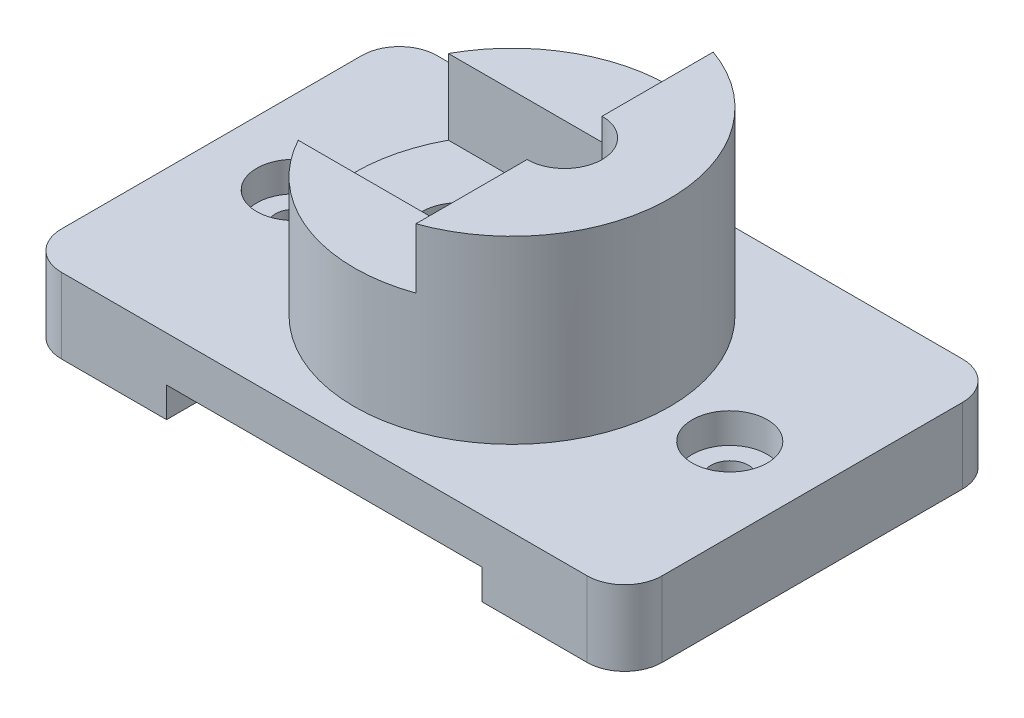
ISO-10303-21;
HEADER;
FILE_DESCRIPTION(('STEP AP214'),'2;1');
FILE_NAME('part.step','',(''),(''),'','','');
FILE_SCHEMA(('AUTOMOTIVE_DESIGN { 1 0 10303 214 1 1 1 1 }'));
ENDSEC;
DATA;
#1=APPLICATION_CONTEXT('core data for automotive mechanical design processes');
#2=APPLICATION_PROTOCOL_DEFINITION('international standard','automotive_design',2000,#1);
#3=PRODUCT_CONTEXT('',#1,'mechanical');
#4=PRODUCT('Part','Part','',(#3));
#5=PRODUCT_RELATED_PRODUCT_CATEGORY('part','',(#4));
#6=PRODUCT_DEFINITION_FORMATION('','',#4);
#7=PRODUCT_DEFINITION_CONTEXT('part definition',#1,'design');
#8=PRODUCT_DEFINITION('design','',#6,#7);
#9=PRODUCT_DEFINITION_SHAPE('','',#8);
#10=(LENGTH_UNIT() NAMED_UNIT(*) SI_UNIT(.MILLI.,.METRE.));
#11=(NAMED_UNIT(*) PLANE_ANGLE_UNIT() SI_UNIT($,.RADIAN.));
#12=(NAMED_UNIT(*) SI_UNIT($,.STERADIAN.) SOLID_ANGLE_UNIT());
#13=UNCERTAINTY_MEASURE_WITH_UNIT(LENGTH_MEASURE(1.E-05),#10,'distance_accuracy_value','');
#14=(GEOMETRIC_REPRESENTATION_CONTEXT(3) GLOBAL_UNCERTAINTY_ASSIGNED_CONTEXT((#13)) GLOBAL_UNIT_ASSIGNED_CONTEXT((#10,
#11,#12)) REPRESENTATION_CONTEXT('',''));
#15=CARTESIAN_POINT('',(0.,0.,0.));
#16=DIRECTION('',(0.,0.,1.));
#17=DIRECTION('',(1.,0.,0.));
#18=AXIS2_PLACEMENT_3D('',#15,#16,#17);
#19=CARTESIAN_POINT('',(-35.,0.,20.));
#20=DIRECTION('',(0.,-1.,0.));
#21=DIRECTION('',(0.,0.,-1.));
#22=AXIS2_PLACEMENT_3D('',#19,#20,#21);
#23=PLANE('',#22);
#24=DIRECTION('',(0.,0.,1.));
#25=VECTOR('',#24,1.);
#26=CARTESIAN_POINT('',(21.,0.,-25.));
#27=LINE('',#26,#25);
#28=CARTESIAN_POINT('',(21.,0.,-25.));
#29=VERTEX_POINT('',#28);
#30=CARTESIAN_POINT('',(21.,0.,25.));
#31=VERTEX_POINT('',#30);
#32=EDGE_CURVE('E205',#29,#31,#27,.T.);
#33=ORIENTED_EDGE('',*,*,#32,.F.);
#34=DIRECTION('',(-1.,0.,0.));
#35=VECTOR('',#34,1.);
#36=CARTESIAN_POINT('',(-35.,0.,-25.));
#37=LINE('',#36,#35);
#38=CARTESIAN_POINT('',(35.,0.,-25.));
#39=VERTEX_POINT('',#38);
#40=EDGE_CURVE('E359',#39,#29,#37,.T.);
#41=ORIENTED_EDGE('',*,*,#40,.F.);
#42=CARTESIAN_POINT('',(35.,0.,-20.));
#43=DIRECTION('',(0.,1.,0.));
#44=DIRECTION('',(0.,0.,-1.));
#45=AXIS2_PLACEMENT_3D('',#42,#43,#44);
#46=CIRCLE('',#45,5.);
#47=CARTESIAN_POINT('',(40.,0.,-20.));
#48=VERTEX_POINT('',#47);
#49=EDGE_CURVE('E356',#48,#39,#46,.T.);
#50=ORIENTED_EDGE('',*,*,#49,.F.);
#51=DIRECTION('',(0.,0.,-1.));
#52=VECTOR('',#51,1.);
#53=CARTESIAN_POINT('',(40.,0.,-20.));
#54=LINE('',#53,#52);
#55=CARTESIAN_POINT('',(40.,0.,20.));
#56=VERTEX_POINT('',#55);
#57=EDGE_CURVE('E354',#56,#48,#54,.T.);
#58=ORIENTED_EDGE('',*,*,#57,.F.);
#59=CARTESIAN_POINT('',(35.,0.,20.));
#60=DIRECTION('',(0.,1.,0.));
#61=DIRECTION('',(0.,0.,-1.));
#62=AXIS2_PLACEMENT_3D('',#59,#60,#61);
#63=CIRCLE('',#62,5.);
#64=CARTESIAN_POINT('',(35.,0.,25.));
#65=VERTEX_POINT('',#64);
#66=EDGE_CURVE('E352',#65,#56,#63,.T.);
#67=ORIENTED_EDGE('',*,*,#66,.F.);
#68=DIRECTION('',(1.,0.,0.));
#69=VECTOR('',#68,1.);
#70=CARTESIAN_POINT('',(-35.,0.,25.));
#71=LINE('',#70,#69);
#72=EDGE_CURVE('E349',#31,#65,#71,.T.);
#73=ORIENTED_EDGE('',*,*,#72,.F.);
#74=EDGE_LOOP('',(#33,#41,#50,#58,#67,#73));
#75=FACE_BOUND('',#74,.T.);
#76=CARTESIAN_POINT('',(29.,0.,0.));
#77=DIRECTION('',(0.,-1.,0.));
#78=DIRECTION('',(0.,0.,1.));
#79=AXIS2_PLACEMENT_3D('',#76,#77,#78);
#80=CIRCLE('',#79,2.5);
#81=CARTESIAN_POINT('',(29.,0.,2.5));
#82=VERTEX_POINT('',#81);
#83=EDGE_CURVE('E231',#82,#82,#80,.T.);
#84=ORIENTED_EDGE('',*,*,#83,.F.);
#85=EDGE_LOOP('',(#84));
#86=FACE_BOUND('',#85,.T.);
#87=ADVANCED_FACE('F35',(#75,#86),#23,.T.);
#88=CARTESIAN_POINT('',(-7.,0.,0.));
#89=DIRECTION('',(0.,1.,0.));
#90=DIRECTION('',(0.,0.,1.));
#91=AXIS2_PLACEMENT_3D('',#88,#89,#90);
#92=CYLINDRICAL_SURFACE('',#91,5.);
#93=DIRECTION('',(0.,1.,0.));
#94=VECTOR('',#93,1.);
#95=CARTESIAN_POINT('',(-7.,0.,5.));
#96=LINE('',#95,#94);
#97=CARTESIAN_POINT('',(-7.,4.,5.));
#98=VERTEX_POINT('',#97);
#99=CARTESIAN_POINT('',(-7.,16.,5.));
#100=VERTEX_POINT('',#99);
#101=EDGE_CURVE('E312',#98,#100,#96,.T.);
#102=ORIENTED_EDGE('',*,*,#101,.F.);
#103=CARTESIAN_POINT('',(-7.,4.,0.));
#104=DIRECTION('',(0.,1.,0.));
#105=DIRECTION('',(-1.,0.,0.));
#106=AXIS2_PLACEMENT_3D('',#103,#104,#105);
#107=CIRCLE('',#106,5.);
#108=CARTESIAN_POINT('',(-7.,4.,-5.));
#109=VERTEX_POINT('',#108);
#110=EDGE_CURVE('E227',#98,#109,#107,.F.);
#111=ORIENTED_EDGE('',*,*,#110,.T.);
#112=DIRECTION('',(0.,1.,0.));
#113=VECTOR('',#112,1.);
#114=CARTESIAN_POINT('',(-7.,0.,-5.));
#115=LINE('',#114,#113);
#116=CARTESIAN_POINT('',(-7.,16.,-5.));
#117=VERTEX_POINT('',#116);
#118=EDGE_CURVE('E313',#109,#117,#115,.T.);
#119=ORIENTED_EDGE('',*,*,#118,.T.);
#120=CARTESIAN_POINT('',(-7.,16.,0.));
#121=DIRECTION('',(0.,1.,0.));
#122=DIRECTION('',(0.,0.,1.));
#123=AXIS2_PLACEMENT_3D('',#120,#121,#122);
#124=CIRCLE('',#123,5.);
#125=EDGE_CURVE('E284',#100,#117,#124,.F.);
#126=ORIENTED_EDGE('',*,*,#125,.F.);
#127=EDGE_LOOP('',(#102,#111,#119,#126));
#128=FACE_BOUND('',#127,.T.);
#129=ADVANCED_FACE('F439',(#128),#92,.F.);
#130=CARTESIAN_POINT('',(-7.,0.,-5.));
#131=DIRECTION('',(0.,0.,-1.));
#132=DIRECTION('',(-1.,0.,0.));
#133=AXIS2_PLACEMENT_3D('',#130,#131,#132);
#134=PLANE('',#133);
#135=ORIENTED_EDGE('',*,*,#118,.F.);
#136=DIRECTION('',(1.,0.,0.));
#137=VECTOR('',#136,1.);
#138=CARTESIAN_POINT('',(-7.,4.,-5.));
#139=LINE('',#138,#137);
#140=CARTESIAN_POINT('',(7.,4.,-5.));
#141=VERTEX_POINT('',#140);
#142=EDGE_CURVE('E224',#109,#141,#139,.T.);
#143=ORIENTED_EDGE('',*,*,#142,.T.);
#144=DIRECTION('',(0.,1.,0.));
#145=VECTOR('',#144,1.);
#146=CARTESIAN_POINT('',(7.,0.,-5.));
#147=LINE('',#146,#145);
#148=CARTESIAN_POINT('',(7.00000000000001,16.,-5.));
#149=VERTEX_POINT('',#148);
#150=EDGE_CURVE('E316',#141,#149,#147,.T.);
#151=ORIENTED_EDGE('',*,*,#150,.T.);
#152=DIRECTION('',(1.,0.,0.));
#153=VECTOR('',#152,1.);
#154=CARTESIAN_POINT('',(-7.,16.,-5.));
#155=LINE('',#154,#153);
#156=EDGE_CURVE('E287',#117,#149,#155,.T.);
#157=ORIENTED_EDGE('',*,*,#156,.F.);
#158=EDGE_LOOP('',(#135,#143,#151,#157));
#159=FACE_BOUND('',#158,.T.);
#160=ADVANCED_FACE('F444',(#159),#134,.F.);
#161=CARTESIAN_POINT('',(7.,0.,5.));
#162=DIRECTION('',(0.,0.,1.));
#163=DIRECTION('',(1.,0.,0.));
#164=AXIS2_PLACEMENT_3D('',#161,#162,#163);
#165=PLANE('',#164);
#166=DIRECTION('',(0.,1.,0.));
#167=VECTOR('',#166,1.);
#168=CARTESIAN_POINT('',(7.,0.,5.));
#169=LINE('',#168,#167);
#170=CARTESIAN_POINT('',(7.,4.,5.));
#171=VERTEX_POINT('',#170);
#172=CARTESIAN_POINT('',(7.00000000000001,16.,5.));
#173=VERTEX_POINT('',#172);
#174=EDGE_CURVE('E318',#171,#173,#169,.T.);
#175=ORIENTED_EDGE('',*,*,#174,.F.);
#176=DIRECTION('',(-1.,0.,0.));
#177=VECTOR('',#176,1.);
#178=CARTESIAN_POINT('',(7.,4.,5.));
#179=LINE('',#178,#177);
#180=EDGE_CURVE('E58',#171,#98,#179,.T.);
#181=ORIENTED_EDGE('',*,*,#180,.T.);
#182=ORIENTED_EDGE('',*,*,#101,.T.);
#183=DIRECTION('',(-1.,0.,0.));
#184=VECTOR('',#183,1.);
#185=CARTESIAN_POINT('',(7.,16.,5.));
#186=LINE('',#185,#184);
#187=EDGE_CURVE('E276',#173,#100,#186,.T.);
#188=ORIENTED_EDGE('',*,*,#187,.F.);
#189=EDGE_LOOP('',(#175,#181,#182,#188));
#190=FACE_BOUND('',#189,.T.);
#191=ADVANCED_FACE('F468',(#190),#165,.F.);
#192=CARTESIAN_POINT('',(0.,26.,0.));
#193=DIRECTION('',(0.,1.,0.));
#194=DIRECTION('',(0.,0.,1.));
#195=AXIS2_PLACEMENT_3D('',#192,#193,#194);
#196=PLANE('',#195);
#197=DIRECTION('',(-1.,0.,0.));
#198=VECTOR('',#197,1.);
#199=CARTESIAN_POINT('',(-18.4661853126194,26.,-10.));
#200=LINE('',#199,#198);
#201=CARTESIAN_POINT('',(7.00000000000001,26.,-10.));
#202=VERTEX_POINT('',#201);
#203=CARTESIAN_POINT('',(-18.4661853126194,26.,-10.));
#204=VERTEX_POINT('',#203);
#205=EDGE_CURVE('E259',#202,#204,#200,.T.);
#206=ORIENTED_EDGE('',*,*,#205,.F.);
#207=DIRECTION('',(0.,0.,-1.));
#208=VECTOR('',#207,1.);
#209=CARTESIAN_POINT('',(7.,26.,-19.7989898732233));
#210=LINE('',#209,#208);
#211=CARTESIAN_POINT('',(7.,26.,-19.7989898732233));
#212=VERTEX_POINT('',#211);
#213=EDGE_CURVE('E294',#202,#212,#210,.T.);
#214=ORIENTED_EDGE('',*,*,#213,.T.);
#215=CARTESIAN_POINT('',(0.,26.,0.));
#216=DIRECTION('',(0.,1.,0.));
#217=DIRECTION('',(0.,0.,1.));
#218=AXIS2_PLACEMENT_3D('',#215,#216,#217);
#219=CIRCLE('',#218,21.);
#220=EDGE_CURVE('E291',#212,#204,#219,.T.);
#221=ORIENTED_EDGE('',*,*,#220,.T.);
#222=EDGE_LOOP('',(#206,#214,#221));
#223=FACE_BOUND('',#222,.T.);
#224=ADVANCED_FACE('F471',(#223),#196,.T.);
#225=CARTESIAN_POINT('',(-35.,10.,20.));
#226=DIRECTION('',(0.,-1.,0.));
#227=DIRECTION('',(0.,0.,-1.));
#228=AXIS2_PLACEMENT_3D('',#225,#226,#227);
#229=CYLINDRICAL_SURFACE('',#228,5.);
#230=CARTESIAN_POINT('',(-35.,0.,20.));
#231=DIRECTION('',(0.,1.,0.));
#232=DIRECTION('',(0.,0.,-1.));
#233=AXIS2_PLACEMENT_3D('',#230,#231,#232);
#234=CIRCLE('',#233,5.);
#235=CARTESIAN_POINT('',(-40.,0.,20.));
#236=VERTEX_POINT('',#235);
#237=CARTESIAN_POINT('',(-35.,0.,25.));
#238=VERTEX_POINT('',#237);
#239=EDGE_CURVE('E324',#236,#238,#234,.T.);
#240=ORIENTED_EDGE('',*,*,#239,.T.);
#241=DIRECTION('',(0.,-1.,0.));
#242=VECTOR('',#241,1.);
#243=CARTESIAN_POINT('',(-35.,10.,25.));
#244=LINE('',#243,#242);
#245=CARTESIAN_POINT('',(-35.,10.,25.));
#246=VERTEX_POINT('',#245);
#247=EDGE_CURVE('E327',#246,#238,#244,.T.);
#248=ORIENTED_EDGE('',*,*,#247,.F.);
#249=CARTESIAN_POINT('',(-35.,10.,20.));
#250=DIRECTION('',(0.,1.,0.));
#251=DIRECTION('',(0.,0.,-1.));
#252=AXIS2_PLACEMENT_3D('',#249,#250,#251);
#253=CIRCLE('',#252,5.);
#254=CARTESIAN_POINT('',(-40.,10.,20.));
#255=VERTEX_POINT('',#254);
#256=EDGE_CURVE('E328',#255,#246,#253,.T.);
#257=ORIENTED_EDGE('',*,*,#256,.F.);
#258=DIRECTION('',(0.,-1.,0.));
#259=VECTOR('',#258,1.);
#260=CARTESIAN_POINT('',(-40.,10.,20.));
#261=LINE('',#260,#259);
#262=EDGE_CURVE('E346',#255,#236,#261,.T.);
#263=ORIENTED_EDGE('',*,*,#262,.T.);
#264=EDGE_LOOP('',(#240,#248,#257,#263));
#265=FACE_BOUND('',#264,.T.);
#266=ADVANCED_FACE('F37',(#265),#229,.T.);
#267=CARTESIAN_POINT('',(-35.,10.,25.));
#268=DIRECTION('',(0.,0.,-1.));
#269=DIRECTION('',(-1.,0.,0.));
#270=AXIS2_PLACEMENT_3D('',#267,#268,#269);
#271=PLANE('',#270);
#272=DIRECTION('',(-1.,0.,0.));
#273=VECTOR('',#272,1.);
#274=CARTESIAN_POINT('',(21.,4.,25.));
#275=LINE('',#274,#273);
#276=CARTESIAN_POINT('',(21.,4.,25.));
#277=VERTEX_POINT('',#276);
#278=CARTESIAN_POINT('',(-21.,3.99999999999999,25.));
#279=VERTEX_POINT('',#278);
#280=EDGE_CURVE('E193',#277,#279,#275,.T.);
#281=ORIENTED_EDGE('',*,*,#280,.F.);
#282=DIRECTION('',(0.,1.,0.));
#283=VECTOR('',#282,1.);
#284=CARTESIAN_POINT('',(21.,0.,25.));
#285=LINE('',#284,#283);
#286=EDGE_CURVE('E202',#31,#277,#285,.T.);
#287=ORIENTED_EDGE('',*,*,#286,.F.);
#288=ORIENTED_EDGE('',*,*,#72,.T.);
#289=DIRECTION('',(0.,-1.,0.));
#290=VECTOR('',#289,1.);
#291=CARTESIAN_POINT('',(35.,10.,25.));
#292=LINE('',#291,#290);
#293=CARTESIAN_POINT('',(35.,10.,25.));
#294=VERTEX_POINT('',#293);
#295=EDGE_CURVE('E382',#294,#65,#292,.T.);
#296=ORIENTED_EDGE('',*,*,#295,.F.);
#297=DIRECTION('',(1.,0.,0.));
#298=VECTOR('',#297,1.);
#299=CARTESIAN_POINT('',(-35.,10.,25.));
#300=LINE('',#299,#298);
#301=EDGE_CURVE('E331',#246,#294,#300,.T.);
#302=ORIENTED_EDGE('',*,*,#301,.F.);
#303=ORIENTED_EDGE('',*,*,#247,.T.);
#304=CARTESIAN_POINT('',(-21.,0.,25.));
#305=VERTEX_POINT('',#304);
#306=EDGE_CURVE('E350',#238,#305,#71,.T.);
#307=ORIENTED_EDGE('',*,*,#306,.T.);
#308=DIRECTION('',(0.,-1.,0.));
#309=VECTOR('',#308,1.);
#310=CARTESIAN_POINT('',(-21.,0.,25.));
#311=LINE('',#310,#309);
#312=EDGE_CURVE('E50',#279,#305,#311,.T.);
#313=ORIENTED_EDGE('',*,*,#312,.F.);
#314=EDGE_LOOP('',(#281,#287,#288,#296,#302,#303,#307,#313));
#315=FACE_BOUND('',#314,.T.);
#316=ADVANCED_FACE('F209',(#315),#271,.F.);
#317=CARTESIAN_POINT('',(35.,10.,20.));
#318=DIRECTION('',(0.,-1.,0.));
#319=DIRECTION('',(0.,0.,-1.));
#320=AXIS2_PLACEMENT_3D('',#317,#318,#319);
#321=CYLINDRICAL_SURFACE('',#320,5.);
#322=ORIENTED_EDGE('',*,*,#66,.T.);
#323=DIRECTION('',(0.,-1.,0.));
#324=VECTOR('',#323,1.);
#325=CARTESIAN_POINT('',(40.,10.,20.));
#326=LINE('',#325,#324);
#327=CARTESIAN_POINT('',(40.,10.,20.));
#328=VERTEX_POINT('',#327);
#329=EDGE_CURVE('E379',#328,#56,#326,.T.);
#330=ORIENTED_EDGE('',*,*,#329,.F.);
#331=CARTESIAN_POINT('',(35.,10.,20.));
#332=DIRECTION('',(0.,1.,0.));
#333=DIRECTION('',(0.,0.,-1.));
#334=AXIS2_PLACEMENT_3D('',#331,#332,#333);
#335=CIRCLE('',#334,5.);
#336=EDGE_CURVE('E334',#294,#328,#335,.T.);
#337=ORIENTED_EDGE('',*,*,#336,.F.);
#338=ORIENTED_EDGE('',*,*,#295,.T.);
#339=EDGE_LOOP('',(#322,#330,#337,#338));
#340=FACE_BOUND('',#339,.T.);
#341=ADVANCED_FACE('F410',(#340),#321,.T.);
#342=CARTESIAN_POINT('',(40.,10.,-20.));
#343=DIRECTION('',(-1.,0.,0.));
#344=DIRECTION('',(0.,0.,1.));
#345=AXIS2_PLACEMENT_3D('',#342,#343,#344);
#346=PLANE('',#345);
#347=ORIENTED_EDGE('',*,*,#57,.T.);
#348=DIRECTION('',(0.,-1.,0.));
#349=VECTOR('',#348,1.);
#350=CARTESIAN_POINT('',(40.,10.,-20.));
#351=LINE('',#350,#349);
#352=CARTESIAN_POINT('',(40.,10.,-20.));
#353=VERTEX_POINT('',#352);
#354=EDGE_CURVE('E376',#353,#48,#351,.T.);
#355=ORIENTED_EDGE('',*,*,#354,.F.);
#356=DIRECTION('',(0.,0.,-1.));
#357=VECTOR('',#356,1.);
#358=CARTESIAN_POINT('',(40.,10.,-20.));
#359=LINE('',#358,#357);
#360=EDGE_CURVE('E336',#328,#353,#359,.T.);
#361=ORIENTED_EDGE('',*,*,#360,.F.);
#362=ORIENTED_EDGE('',*,*,#329,.T.);
#363=EDGE_LOOP('',(#347,#355,#361,#362));
#364=FACE_BOUND('',#363,.T.);
#365=ADVANCED_FACE('F429',(#364),#346,.F.);
#366=CARTESIAN_POINT('',(35.,10.,-20.));
#367=DIRECTION('',(0.,-1.,0.));
#368=DIRECTION('',(0.,0.,-1.));
#369=AXIS2_PLACEMENT_3D('',#366,#367,#368);
#370=CYLINDRICAL_SURFACE('',#369,5.);
#371=ORIENTED_EDGE('',*,*,#49,.T.);
#372=DIRECTION('',(0.,-1.,0.));
#373=VECTOR('',#372,1.);
#374=CARTESIAN_POINT('',(35.,10.,-25.));
#375=LINE('',#374,#373);
#376=CARTESIAN_POINT('',(35.,10.,-25.));
#377=VERTEX_POINT('',#376);
#378=EDGE_CURVE('E373',#377,#39,#375,.T.);
#379=ORIENTED_EDGE('',*,*,#378,.F.);
#380=CARTESIAN_POINT('',(35.,10.,-20.));
#381=DIRECTION('',(0.,1.,0.));
#382=DIRECTION('',(0.,0.,-1.));
#383=AXIS2_PLACEMENT_3D('',#380,#381,#382);
#384=CIRCLE('',#383,5.);
#385=EDGE_CURVE('E338',#353,#377,#384,.T.);
#386=ORIENTED_EDGE('',*,*,#385,.F.);
#387=ORIENTED_EDGE('',*,*,#354,.T.);
#388=EDGE_LOOP('',(#371,#379,#386,#387));
#389=FACE_BOUND('',#388,.T.);
#390=ADVANCED_FACE('F427',(#389),#370,.T.);
#391=CARTESIAN_POINT('',(-35.,10.,-25.));
#392=DIRECTION('',(0.,0.,1.));
#393=DIRECTION('',(1.,0.,0.));
#394=AXIS2_PLACEMENT_3D('',#391,#392,#393);
#395=PLANE('',#394);
#396=ORIENTED_EDGE('',*,*,#40,.T.);
#397=DIRECTION('',(0.,1.,0.));
#398=VECTOR('',#397,1.);
#399=CARTESIAN_POINT('',(21.,0.,-25.));
#400=LINE('',#399,#398);
#401=CARTESIAN_POINT('',(21.,4.,-25.));
#402=VERTEX_POINT('',#401);
#403=EDGE_CURVE('E212',#29,#402,#400,.T.);
#404=ORIENTED_EDGE('',*,*,#403,.T.);
#405=DIRECTION('',(-1.,0.,0.));
#406=VECTOR('',#405,1.);
#407=CARTESIAN_POINT('',(21.,4.,-25.));
#408=LINE('',#407,#406);
#409=CARTESIAN_POINT('',(-21.,3.99999999999999,-25.));
#410=VERTEX_POINT('',#409);
#411=EDGE_CURVE('E195',#402,#410,#408,.T.);
#412=ORIENTED_EDGE('',*,*,#411,.T.);
#413=DIRECTION('',(0.,-1.,0.));
#414=VECTOR('',#413,1.);
#415=CARTESIAN_POINT('',(-21.,0.,-25.));
#416=LINE('',#415,#414);
#417=CARTESIAN_POINT('',(-21.,0.,-25.));
#418=VERTEX_POINT('',#417);
#419=EDGE_CURVE('E199',#410,#418,#416,.T.);
#420=ORIENTED_EDGE('',*,*,#419,.T.);
#421=CARTESIAN_POINT('',(-35.,0.,-25.));
#422=VERTEX_POINT('',#421);
#423=EDGE_CURVE('E358',#418,#422,#37,.T.);
#424=ORIENTED_EDGE('',*,*,#423,.T.);
#425=DIRECTION('',(0.,-1.,0.));
#426=VECTOR('',#425,1.);
#427=CARTESIAN_POINT('',(-35.,10.,-25.));
#428=LINE('',#427,#426);
#429=CARTESIAN_POINT('',(-35.,10.,-25.));
#430=VERTEX_POINT('',#429);
#431=EDGE_CURVE('E370',#430,#422,#428,.T.);
#432=ORIENTED_EDGE('',*,*,#431,.F.);
#433=DIRECTION('',(-1.,0.,0.));
#434=VECTOR('',#433,1.);
#435=CARTESIAN_POINT('',(-35.,10.,-25.));
#436=LINE('',#435,#434);
#437=EDGE_CURVE('E340',#377,#430,#436,.T.);
#438=ORIENTED_EDGE('',*,*,#437,.F.);
#439=ORIENTED_EDGE('',*,*,#378,.T.);
#440=EDGE_LOOP('',(#396,#404,#412,#420,#424,#432,#438,#439));
#441=FACE_BOUND('',#440,.T.);
#442=ADVANCED_FACE('F400',(#441),#395,.F.);
#443=CARTESIAN_POINT('',(-35.,10.,-20.));
#444=DIRECTION('',(0.,-1.,0.));
#445=DIRECTION('',(0.,0.,-1.));
#446=AXIS2_PLACEMENT_3D('',#443,#444,#445);
#447=CYLINDRICAL_SURFACE('',#446,5.);
#448=CARTESIAN_POINT('',(-35.,0.,-20.));
#449=DIRECTION('',(0.,1.,0.));
#450=DIRECTION('',(0.,0.,1.));
#451=AXIS2_PLACEMENT_3D('',#448,#449,#450);
#452=CIRCLE('',#451,5.);
#453=CARTESIAN_POINT('',(-40.,0.,-20.));
#454=VERTEX_POINT('',#453);
#455=EDGE_CURVE('E362',#422,#454,#452,.T.);
#456=ORIENTED_EDGE('',*,*,#455,.T.);
#457=DIRECTION('',(0.,-1.,0.));
#458=VECTOR('',#457,1.);
#459=CARTESIAN_POINT('',(-40.,10.,-20.));
#460=LINE('',#459,#458);
#461=CARTESIAN_POINT('',(-40.,10.,-20.));
#462=VERTEX_POINT('',#461);
#463=EDGE_CURVE('E367',#462,#454,#460,.T.);
#464=ORIENTED_EDGE('',*,*,#463,.F.);
#465=CARTESIAN_POINT('',(-35.,10.,-20.));
#466=DIRECTION('',(0.,1.,0.));
#467=DIRECTION('',(0.,0.,1.));
#468=AXIS2_PLACEMENT_3D('',#465,#466,#467);
#469=CIRCLE('',#468,5.);
#470=EDGE_CURVE('E342',#430,#462,#469,.T.);
#471=ORIENTED_EDGE('',*,*,#470,.F.);
#472=ORIENTED_EDGE('',*,*,#431,.T.);
#473=EDGE_LOOP('',(#456,#464,#471,#472));
#474=FACE_BOUND('',#473,.T.);
#475=ADVANCED_FACE('F422',(#474),#447,.T.);
#476=CARTESIAN_POINT('',(-40.,10.,-20.));
#477=DIRECTION('',(1.,0.,0.));
#478=DIRECTION('',(0.,0.,-1.));
#479=AXIS2_PLACEMENT_3D('',#476,#477,#478);
#480=PLANE('',#479);
#481=DIRECTION('',(0.,0.,1.));
#482=VECTOR('',#481,1.);
#483=CARTESIAN_POINT('',(-40.,0.,-20.));
#484=LINE('',#483,#482);
#485=EDGE_CURVE('E332',#454,#236,#484,.T.);
#486=ORIENTED_EDGE('',*,*,#485,.T.);
#487=ORIENTED_EDGE('',*,*,#262,.F.);
#488=DIRECTION('',(0.,0.,1.));
#489=VECTOR('',#488,1.);
#490=CARTESIAN_POINT('',(-40.,10.,-20.));
#491=LINE('',#490,#489);
#492=EDGE_CURVE('E344',#462,#255,#491,.T.);
#493=ORIENTED_EDGE('',*,*,#492,.F.);
#494=ORIENTED_EDGE('',*,*,#463,.T.);
#495=EDGE_LOOP('',(#486,#487,#493,#494));
#496=FACE_BOUND('',#495,.T.);
#497=ADVANCED_FACE('F420',(#496),#480,.F.);
#498=CARTESIAN_POINT('',(-35.,10.,20.));
#499=DIRECTION('',(0.,-1.,0.));
#500=DIRECTION('',(0.,0.,-1.));
#501=AXIS2_PLACEMENT_3D('',#498,#499,#500);
#502=PLANE('',#501);
#503=CARTESIAN_POINT('',(29.,10.,0.));
#504=DIRECTION('',(0.,-1.,0.));
#505=DIRECTION('',(0.,0.,1.));
#506=AXIS2_PLACEMENT_3D('',#503,#504,#505);
#507=CIRCLE('',#506,5.);
#508=CARTESIAN_POINT('',(29.,10.,5.));
#509=VERTEX_POINT('',#508);
#510=EDGE_CURVE('E234',#509,#509,#507,.T.);
#511=ORIENTED_EDGE('',*,*,#510,.T.);
#512=EDGE_LOOP('',(#511));
#513=FACE_BOUND('',#512,.T.);
#514=CARTESIAN_POINT('',(-29.,10.,0.));
#515=DIRECTION('',(0.,1.,0.));
#516=DIRECTION('',(0.,0.,1.));
#517=AXIS2_PLACEMENT_3D('',#514,#515,#516);
#518=CIRCLE('',#517,5.);
#519=CARTESIAN_POINT('',(-29.,10.,5.));
#520=VERTEX_POINT('',#519);
#521=EDGE_CURVE('E246',#520,#520,#518,.T.);
#522=ORIENTED_EDGE('',*,*,#521,.F.);
#523=EDGE_LOOP('',(#522));
#524=FACE_BOUND('',#523,.T.);
#525=CARTESIAN_POINT('',(0.,10.,0.));
#526=DIRECTION('',(0.,-1.,0.));
#527=DIRECTION('',(0.,0.,-1.));
#528=AXIS2_PLACEMENT_3D('',#525,#526,#527);
#529=CIRCLE('',#528,21.);
#530=CARTESIAN_POINT('',(0.,10.,-21.));
#531=VERTEX_POINT('',#530);
#532=EDGE_CURVE('E43',#531,#531,#529,.F.);
#533=ORIENTED_EDGE('',*,*,#532,.F.);
#534=EDGE_LOOP('',(#533));
#535=FACE_BOUND('',#534,.T.);
#536=ORIENTED_EDGE('',*,*,#256,.T.);
#537=ORIENTED_EDGE('',*,*,#301,.T.);
#538=ORIENTED_EDGE('',*,*,#336,.T.);
#539=ORIENTED_EDGE('',*,*,#360,.T.);
#540=ORIENTED_EDGE('',*,*,#385,.T.);
#541=ORIENTED_EDGE('',*,*,#437,.T.);
#542=ORIENTED_EDGE('',*,*,#470,.T.);
#543=ORIENTED_EDGE('',*,*,#492,.T.);
#544=EDGE_LOOP('',(#536,#537,#538,#539,#540,#541,#542,#543));
#545=FACE_BOUND('',#544,.T.);
#546=ADVANCED_FACE('F414',(#513,#524,#535,#545),#502,.F.);
#547=DIRECTION('',(0.,0.,1.));
#548=VECTOR('',#547,1.);
#549=CARTESIAN_POINT('',(-21.,0.,-25.));
#550=LINE('',#549,#548);
#551=EDGE_CURVE('E220',#418,#305,#550,.T.);
#552=ORIENTED_EDGE('',*,*,#551,.T.);
#553=ORIENTED_EDGE('',*,*,#306,.F.);
#554=ORIENTED_EDGE('',*,*,#239,.F.);
#555=ORIENTED_EDGE('',*,*,#485,.F.);
#556=ORIENTED_EDGE('',*,*,#455,.F.);
#557=ORIENTED_EDGE('',*,*,#423,.F.);
#558=EDGE_LOOP('',(#552,#553,#554,#555,#556,#557));
#559=FACE_BOUND('',#558,.T.);
#560=CARTESIAN_POINT('',(-29.,0.,0.));
#561=DIRECTION('',(0.,1.,0.));
#562=DIRECTION('',(0.,0.,1.));
#563=AXIS2_PLACEMENT_3D('',#560,#561,#562);
#564=CIRCLE('',#563,2.5);
#565=CARTESIAN_POINT('',(-29.,0.,2.5));
#566=VERTEX_POINT('',#565);
#567=EDGE_CURVE('E243',#566,#566,#564,.T.);
#568=ORIENTED_EDGE('',*,*,#567,.T.);
#569=EDGE_LOOP('',(#568));
#570=FACE_BOUND('',#569,.T.);
#571=ADVANCED_FACE('F393',(#559,#570),#23,.T.);
#572=CARTESIAN_POINT('',(0.,34.,0.));
#573=DIRECTION('',(0.,-1.,0.));
#574=DIRECTION('',(0.,0.,-1.));
#575=AXIS2_PLACEMENT_3D('',#572,#573,#574);
#576=CYLINDRICAL_SURFACE('',#575,21.);
#577=CARTESIAN_POINT('',(0.,16.,0.));
#578=DIRECTION('',(0.,1.,0.));
#579=DIRECTION('',(0.,0.,1.));
#580=AXIS2_PLACEMENT_3D('',#577,#578,#579);
#581=CIRCLE('',#580,21.);
#582=CARTESIAN_POINT('',(-18.4661853126194,16.,-10.));
#583=VERTEX_POINT('',#582);
#584=CARTESIAN_POINT('',(-18.4661853126194,16.,10.));
#585=VERTEX_POINT('',#584);
#586=EDGE_CURVE('E255',#583,#585,#581,.T.);
#587=ORIENTED_EDGE('',*,*,#586,.F.);
#588=DIRECTION('',(0.,1.,0.));
#589=VECTOR('',#588,1.);
#590=CARTESIAN_POINT('',(-18.4661853126194,16.,-10.));
#591=LINE('',#590,#589);
#592=EDGE_CURVE('E273',#583,#204,#591,.T.);
#593=ORIENTED_EDGE('',*,*,#592,.T.);
#594=ORIENTED_EDGE('',*,*,#220,.F.);
#595=DIRECTION('',(0.,1.,0.));
#596=VECTOR('',#595,1.);
#597=CARTESIAN_POINT('',(7.,26.,-19.7989898732233));
#598=LINE('',#597,#596);
#599=CARTESIAN_POINT('',(7.,34.,-19.7989898732233));
#600=VERTEX_POINT('',#599);
#601=EDGE_CURVE('E302',#212,#600,#598,.T.);
#602=ORIENTED_EDGE('',*,*,#601,.T.);
#603=CARTESIAN_POINT('',(0.,34.,0.));
#604=DIRECTION('',(0.,1.,0.));
#605=DIRECTION('',(0.,0.,1.));
#606=AXIS2_PLACEMENT_3D('',#603,#604,#605);
#607=CIRCLE('',#606,21.);
#608=CARTESIAN_POINT('',(7.00000000000001,34.,19.7989898732233));
#609=VERTEX_POINT('',#608);
#610=EDGE_CURVE('E315',#609,#600,#607,.T.);
#611=ORIENTED_EDGE('',*,*,#610,.F.);
#612=DIRECTION('',(0.,1.,0.));
#613=VECTOR('',#612,1.);
#614=CARTESIAN_POINT('',(7.00000000000001,26.,19.7989898732233));
#615=LINE('',#614,#613);
#616=CARTESIAN_POINT('',(7.00000000000001,26.,19.7989898732233));
#617=VERTEX_POINT('',#616);
#618=EDGE_CURVE('E299',#617,#609,#615,.T.);
#619=ORIENTED_EDGE('',*,*,#618,.F.);
#620=CARTESIAN_POINT('',(-18.4661853126194,26.,10.));
#621=VERTEX_POINT('',#620);
#622=EDGE_CURVE('E295',#621,#617,#219,.T.);
#623=ORIENTED_EDGE('',*,*,#622,.F.);
#624=DIRECTION('',(0.,1.,0.));
#625=VECTOR('',#624,1.);
#626=CARTESIAN_POINT('',(-18.4661853126194,16.,10.));
#627=LINE('',#626,#625);
#628=EDGE_CURVE('E269',#585,#621,#627,.T.);
#629=ORIENTED_EDGE('',*,*,#628,.F.);
#630=EDGE_LOOP('',(#587,#593,#594,#602,#611,#619,#623,#629));
#631=FACE_BOUND('',#630,.T.);
#632=ORIENTED_EDGE('',*,*,#532,.T.);
#633=EDGE_LOOP('',(#632));
#634=FACE_BOUND('',#633,.T.);
#635=ADVANCED_FACE('F450',(#631,#634),#576,.T.);
#636=CARTESIAN_POINT('',(0.,34.,0.));
#637=DIRECTION('',(0.,1.,0.));
#638=DIRECTION('',(0.,0.,1.));
#639=AXIS2_PLACEMENT_3D('',#636,#637,#638);
#640=PLANE('',#639);
#641=DIRECTION('',(0.,0.,-1.));
#642=VECTOR('',#641,1.);
#643=CARTESIAN_POINT('',(7.,34.,-19.7989898732233));
#644=LINE('',#643,#642);
#645=CARTESIAN_POINT('',(7.,34.,5.));
#646=VERTEX_POINT('',#645);
#647=EDGE_CURVE('E300',#609,#646,#644,.T.);
#648=ORIENTED_EDGE('',*,*,#647,.F.);
#649=ORIENTED_EDGE('',*,*,#610,.T.);
#650=CARTESIAN_POINT('',(7.,34.,-5.));
#651=VERTEX_POINT('',#650);
#652=EDGE_CURVE('E290',#651,#600,#644,.T.);
#653=ORIENTED_EDGE('',*,*,#652,.F.);
#654=CARTESIAN_POINT('',(7.,34.,0.));
#655=DIRECTION('',(0.,1.,0.));
#656=DIRECTION('',(0.,0.,1.));
#657=AXIS2_PLACEMENT_3D('',#654,#655,#656);
#658=CIRCLE('',#657,5.);
#659=EDGE_CURVE('E309',#646,#651,#658,.T.);
#660=ORIENTED_EDGE('',*,*,#659,.F.);
#661=EDGE_LOOP('',(#648,#649,#653,#660));
#662=FACE_BOUND('',#661,.T.);
#663=ADVANCED_FACE('F455',(#662),#640,.T.);
#664=CARTESIAN_POINT('',(7.,0.,0.));
#665=DIRECTION('',(0.,1.,0.));
#666=DIRECTION('',(0.,0.,1.));
#667=AXIS2_PLACEMENT_3D('',#664,#665,#666);
#668=CYLINDRICAL_SURFACE('',#667,5.);
#669=ORIENTED_EDGE('',*,*,#150,.F.);
#670=CARTESIAN_POINT('',(7.,4.,0.));
#671=DIRECTION('',(0.,1.,0.));
#672=DIRECTION('',(-1.,0.,0.));
#673=AXIS2_PLACEMENT_3D('',#670,#671,#672);
#674=CIRCLE('',#673,5.);
#675=EDGE_CURVE('E11',#141,#171,#674,.F.);
#676=ORIENTED_EDGE('',*,*,#675,.T.);
#677=ORIENTED_EDGE('',*,*,#174,.T.);
#678=EDGE_CURVE('E320',#173,#646,#169,.T.);
#679=ORIENTED_EDGE('',*,*,#678,.T.);
#680=ORIENTED_EDGE('',*,*,#659,.T.);
#681=DIRECTION('',(0.,1.,0.));
#682=VECTOR('',#681,1.);
#683=CARTESIAN_POINT('',(7.,0.,-5.));
#684=LINE('',#683,#682);
#685=EDGE_CURVE('E305',#651,#149,#684,.F.);
#686=ORIENTED_EDGE('',*,*,#685,.T.);
#687=EDGE_LOOP('',(#669,#676,#677,#679,#680,#686));
#688=FACE_BOUND('',#687,.T.);
#689=ADVANCED_FACE('F465',(#688),#668,.F.);
#690=CARTESIAN_POINT('',(7.,26.,-19.7989898732233));
#691=DIRECTION('',(1.,0.,0.));
#692=DIRECTION('',(0.,0.,-1.));
#693=AXIS2_PLACEMENT_3D('',#690,#691,#692);
#694=PLANE('',#693);
#695=ORIENTED_EDGE('',*,*,#652,.T.);
#696=ORIENTED_EDGE('',*,*,#601,.F.);
#697=ORIENTED_EDGE('',*,*,#213,.F.);
#698=DIRECTION('',(0.,1.,0.));
#699=VECTOR('',#698,1.);
#700=CARTESIAN_POINT('',(7.00000000000001,16.,-10.));
#701=LINE('',#700,#699);
#702=CARTESIAN_POINT('',(7.00000000000001,16.,-10.));
#703=VERTEX_POINT('',#702);
#704=EDGE_CURVE('E277',#703,#202,#701,.T.);
#705=ORIENTED_EDGE('',*,*,#704,.F.);
#706=DIRECTION('',(0.,0.,-1.));
#707=VECTOR('',#706,1.);
#708=CARTESIAN_POINT('',(7.00000000000001,16.,-10.));
#709=LINE('',#708,#707);
#710=EDGE_CURVE('E262',#149,#703,#709,.T.);
#711=ORIENTED_EDGE('',*,*,#710,.F.);
#712=ORIENTED_EDGE('',*,*,#685,.F.);
#713=EDGE_LOOP('',(#695,#696,#697,#705,#711,#712));
#714=FACE_BOUND('',#713,.T.);
#715=ADVANCED_FACE('F475',(#714),#694,.F.);
#716=CARTESIAN_POINT('',(7.00000000000001,26.,10.));
#717=VERTEX_POINT('',#716);
#718=EDGE_CURVE('E296',#617,#717,#210,.T.);
#719=ORIENTED_EDGE('',*,*,#718,.F.);
#720=ORIENTED_EDGE('',*,*,#618,.T.);
#721=ORIENTED_EDGE('',*,*,#647,.T.);
#722=ORIENTED_EDGE('',*,*,#678,.F.);
#723=CARTESIAN_POINT('',(7.00000000000001,16.,10.));
#724=VERTEX_POINT('',#723);
#725=EDGE_CURVE('E263',#724,#173,#709,.T.);
#726=ORIENTED_EDGE('',*,*,#725,.F.);
#727=DIRECTION('',(0.,1.,0.));
#728=VECTOR('',#727,1.);
#729=CARTESIAN_POINT('',(7.00000000000001,16.,10.));
#730=LINE('',#729,#728);
#731=EDGE_CURVE('E279',#724,#717,#730,.T.);
#732=ORIENTED_EDGE('',*,*,#731,.T.);
#733=EDGE_LOOP('',(#719,#720,#721,#722,#726,#732));
#734=FACE_BOUND('',#733,.T.);
#735=ADVANCED_FACE('F482',(#734),#694,.F.);
#736=DIRECTION('',(1.,0.,0.));
#737=VECTOR('',#736,1.);
#738=CARTESIAN_POINT('',(7.00000000000001,26.,10.));
#739=LINE('',#738,#737);
#740=EDGE_CURVE('E252',#621,#717,#739,.T.);
#741=ORIENTED_EDGE('',*,*,#740,.F.);
#742=ORIENTED_EDGE('',*,*,#622,.T.);
#743=ORIENTED_EDGE('',*,*,#718,.T.);
#744=EDGE_LOOP('',(#741,#742,#743));
#745=FACE_BOUND('',#744,.T.);
#746=ADVANCED_FACE('F484',(#745),#196,.T.);
#747=CARTESIAN_POINT('',(0.,16.,0.));
#748=DIRECTION('',(0.,1.,0.));
#749=DIRECTION('',(0.,0.,1.));
#750=AXIS2_PLACEMENT_3D('',#747,#748,#749);
#751=PLANE('',#750);
#752=ORIENTED_EDGE('',*,*,#156,.T.);
#753=ORIENTED_EDGE('',*,*,#710,.T.);
#754=DIRECTION('',(-1.,0.,0.));
#755=VECTOR('',#754,1.);
#756=CARTESIAN_POINT('',(-18.4661853126194,16.,-10.));
#757=LINE('',#756,#755);
#758=EDGE_CURVE('E266',#703,#583,#757,.T.);
#759=ORIENTED_EDGE('',*,*,#758,.T.);
#760=ORIENTED_EDGE('',*,*,#586,.T.);
#761=DIRECTION('',(1.,0.,0.));
#762=VECTOR('',#761,1.);
#763=CARTESIAN_POINT('',(7.00000000000001,16.,10.));
#764=LINE('',#763,#762);
#765=EDGE_CURVE('E258',#585,#724,#764,.T.);
#766=ORIENTED_EDGE('',*,*,#765,.T.);
#767=ORIENTED_EDGE('',*,*,#725,.T.);
#768=ORIENTED_EDGE('',*,*,#187,.T.);
#769=ORIENTED_EDGE('',*,*,#125,.T.);
#770=EDGE_LOOP('',(#752,#753,#759,#760,#766,#767,#768,#769));
#771=FACE_BOUND('',#770,.T.);
#772=ADVANCED_FACE('F487',(#771),#751,.T.);
#773=CARTESIAN_POINT('',(-18.4661853126194,16.,-10.));
#774=DIRECTION('',(0.,0.,-1.));
#775=DIRECTION('',(-1.,0.,0.));
#776=AXIS2_PLACEMENT_3D('',#773,#774,#775);
#777=PLANE('',#776);
#778=ORIENTED_EDGE('',*,*,#205,.T.);
#779=ORIENTED_EDGE('',*,*,#592,.F.);
#780=ORIENTED_EDGE('',*,*,#758,.F.);
#781=ORIENTED_EDGE('',*,*,#704,.T.);
#782=EDGE_LOOP('',(#778,#779,#780,#781));
#783=FACE_BOUND('',#782,.T.);
#784=ADVANCED_FACE('F493',(#783),#777,.F.);
#785=CARTESIAN_POINT('',(7.00000000000001,16.,10.));
#786=DIRECTION('',(0.,0.,1.));
#787=DIRECTION('',(1.,0.,0.));
#788=AXIS2_PLACEMENT_3D('',#785,#786,#787);
#789=PLANE('',#788);
#790=ORIENTED_EDGE('',*,*,#740,.T.);
#791=ORIENTED_EDGE('',*,*,#731,.F.);
#792=ORIENTED_EDGE('',*,*,#765,.F.);
#793=ORIENTED_EDGE('',*,*,#628,.T.);
#794=EDGE_LOOP('',(#790,#791,#792,#793));
#795=FACE_BOUND('',#794,.T.);
#796=ADVANCED_FACE('F489',(#795),#789,.F.);
#797=CARTESIAN_POINT('',(-29.,6.,0.));
#798=DIRECTION('',(0.,1.,0.));
#799=DIRECTION('',(0.,0.,1.));
#800=AXIS2_PLACEMENT_3D('',#797,#798,#799);
#801=CYLINDRICAL_SURFACE('',#800,5.);
#802=CARTESIAN_POINT('',(-29.,6.,0.));
#803=DIRECTION('',(0.,1.,0.));
#804=DIRECTION('',(0.,0.,1.));
#805=AXIS2_PLACEMENT_3D('',#802,#803,#804);
#806=CIRCLE('',#805,5.);
#807=CARTESIAN_POINT('',(-29.,6.,5.));
#808=VERTEX_POINT('',#807);
#809=EDGE_CURVE('E249',#808,#808,#806,.T.);
#810=ORIENTED_EDGE('',*,*,#809,.F.);
#811=EDGE_LOOP('',(#810));
#812=FACE_BOUND('',#811,.T.);
#813=ORIENTED_EDGE('',*,*,#521,.T.);
#814=EDGE_LOOP('',(#813));
#815=FACE_BOUND('',#814,.T.);
#816=ADVANCED_FACE('F492',(#812,#815),#801,.F.);
#817=CARTESIAN_POINT('',(-29.,6.,0.));
#818=DIRECTION('',(0.,1.,0.));
#819=DIRECTION('',(0.,0.,1.));
#820=AXIS2_PLACEMENT_3D('',#817,#818,#819);
#821=PLANE('',#820);
#822=CARTESIAN_POINT('',(-29.,6.,0.));
#823=DIRECTION('',(0.,1.,0.));
#824=DIRECTION('',(0.,0.,1.));
#825=AXIS2_PLACEMENT_3D('',#822,#823,#824);
#826=CIRCLE('',#825,2.5);
#827=CARTESIAN_POINT('',(-29.,6.,2.5));
#828=VERTEX_POINT('',#827);
#829=EDGE_CURVE('E240',#828,#828,#826,.T.);
#830=ORIENTED_EDGE('',*,*,#829,.F.);
#831=EDGE_LOOP('',(#830));
#832=FACE_BOUND('',#831,.T.);
#833=ORIENTED_EDGE('',*,*,#809,.T.);
#834=EDGE_LOOP('',(#833));
#835=FACE_BOUND('',#834,.T.);
#836=ADVANCED_FACE('F503',(#832,#835),#821,.T.);
#837=CARTESIAN_POINT('',(-29.,0.,0.));
#838=DIRECTION('',(0.,1.,0.));
#839=DIRECTION('',(0.,0.,1.));
#840=AXIS2_PLACEMENT_3D('',#837,#838,#839);
#841=CYLINDRICAL_SURFACE('',#840,2.5);
#842=ORIENTED_EDGE('',*,*,#567,.F.);
#843=EDGE_LOOP('',(#842));
#844=FACE_BOUND('',#843,.T.);
#845=ORIENTED_EDGE('',*,*,#829,.T.);
#846=EDGE_LOOP('',(#845));
#847=FACE_BOUND('',#846,.T.);
#848=ADVANCED_FACE('F507',(#844,#847),#841,.F.);
#849=CARTESIAN_POINT('',(29.,6.,0.));
#850=DIRECTION('',(0.,1.,0.));
#851=DIRECTION('',(0.,0.,1.));
#852=AXIS2_PLACEMENT_3D('',#849,#850,#851);
#853=CYLINDRICAL_SURFACE('',#852,5.);
#854=CARTESIAN_POINT('',(29.,6.,0.));
#855=DIRECTION('',(0.,-1.,0.));
#856=DIRECTION('',(0.,0.,1.));
#857=AXIS2_PLACEMENT_3D('',#854,#855,#856);
#858=CIRCLE('',#857,5.);
#859=CARTESIAN_POINT('',(29.,6.,5.));
#860=VERTEX_POINT('',#859);
#861=EDGE_CURVE('E237',#860,#860,#858,.T.);
#862=ORIENTED_EDGE('',*,*,#861,.T.);
#863=EDGE_LOOP('',(#862));
#864=FACE_BOUND('',#863,.T.);
#865=ORIENTED_EDGE('',*,*,#510,.F.);
#866=EDGE_LOOP('',(#865));
#867=FACE_BOUND('',#866,.T.);
#868=ADVANCED_FACE('F511',(#864,#867),#853,.F.);
#869=CARTESIAN_POINT('',(29.,6.,0.));
#870=DIRECTION('',(0.,1.,0.));
#871=DIRECTION('',(0.,0.,1.));
#872=AXIS2_PLACEMENT_3D('',#869,#870,#871);
#873=PLANE('',#872);
#874=CARTESIAN_POINT('',(29.,6.,0.));
#875=DIRECTION('',(0.,-1.,0.));
#876=DIRECTION('',(0.,0.,1.));
#877=AXIS2_PLACEMENT_3D('',#874,#875,#876);
#878=CIRCLE('',#877,2.5);
#879=CARTESIAN_POINT('',(29.,6.,2.5));
#880=VERTEX_POINT('',#879);
#881=EDGE_CURVE('E230',#880,#880,#878,.T.);
#882=ORIENTED_EDGE('',*,*,#881,.T.);
#883=EDGE_LOOP('',(#882));
#884=FACE_BOUND('',#883,.T.);
#885=ORIENTED_EDGE('',*,*,#861,.F.);
#886=EDGE_LOOP('',(#885));
#887=FACE_BOUND('',#886,.T.);
#888=ADVANCED_FACE('F515',(#884,#887),#873,.T.);
#889=CARTESIAN_POINT('',(29.,0.,0.));
#890=DIRECTION('',(0.,1.,0.));
#891=DIRECTION('',(0.,0.,1.));
#892=AXIS2_PLACEMENT_3D('',#889,#890,#891);
#893=CYLINDRICAL_SURFACE('',#892,2.5);
#894=ORIENTED_EDGE('',*,*,#83,.T.);
#895=EDGE_LOOP('',(#894));
#896=FACE_BOUND('',#895,.T.);
#897=ORIENTED_EDGE('',*,*,#881,.F.);
#898=EDGE_LOOP('',(#897));
#899=FACE_BOUND('',#898,.T.);
#900=ADVANCED_FACE('F519',(#896,#899),#893,.F.);
#901=CARTESIAN_POINT('',(21.,4.,-25.));
#902=DIRECTION('',(0.,1.,0.));
#903=DIRECTION('',(-1.,0.,0.));
#904=AXIS2_PLACEMENT_3D('',#901,#902,#903);
#905=PLANE('',#904);
#906=DIRECTION('',(0.,0.,1.));
#907=VECTOR('',#906,1.);
#908=CARTESIAN_POINT('',(-21.,3.99999999999999,-25.));
#909=LINE('',#908,#907);
#910=EDGE_CURVE('E198',#410,#279,#909,.T.);
#911=ORIENTED_EDGE('',*,*,#910,.F.);
#912=ORIENTED_EDGE('',*,*,#411,.F.);
#913=DIRECTION('',(0.,0.,1.));
#914=VECTOR('',#913,1.);
#915=CARTESIAN_POINT('',(21.,4.,-25.));
#916=LINE('',#915,#914);
#917=EDGE_CURVE('E189',#402,#277,#916,.T.);
#918=ORIENTED_EDGE('',*,*,#917,.T.);
#919=ORIENTED_EDGE('',*,*,#280,.T.);
#920=EDGE_LOOP('',(#911,#912,#918,#919));
#921=FACE_BOUND('',#920,.T.);
#922=ORIENTED_EDGE('',*,*,#180,.F.);
#923=ORIENTED_EDGE('',*,*,#675,.F.);
#924=ORIENTED_EDGE('',*,*,#142,.F.);
#925=ORIENTED_EDGE('',*,*,#110,.F.);
#926=EDGE_LOOP('',(#922,#923,#924,#925));
#927=FACE_BOUND('',#926,.T.);
#928=ADVANCED_FACE('F191',(#921,#927),#905,.F.);
#929=CARTESIAN_POINT('',(21.,0.,-25.));
#930=DIRECTION('',(1.,0.,0.));
#931=DIRECTION('',(0.,0.,-1.));
#932=AXIS2_PLACEMENT_3D('',#929,#930,#931);
#933=PLANE('',#932);
#934=ORIENTED_EDGE('',*,*,#917,.F.);
#935=ORIENTED_EDGE('',*,*,#403,.F.);
#936=ORIENTED_EDGE('',*,*,#32,.T.);
#937=ORIENTED_EDGE('',*,*,#286,.T.);
#938=EDGE_LOOP('',(#934,#935,#936,#937));
#939=FACE_BOUND('',#938,.T.);
#940=ADVANCED_FACE('F203',(#939),#933,.F.);
#941=CARTESIAN_POINT('',(-21.,0.,-25.));
#942=DIRECTION('',(-1.,0.,0.));
#943=DIRECTION('',(0.,0.,1.));
#944=AXIS2_PLACEMENT_3D('',#941,#942,#943);
#945=PLANE('',#944);
#946=ORIENTED_EDGE('',*,*,#551,.F.);
#947=ORIENTED_EDGE('',*,*,#419,.F.);
#948=ORIENTED_EDGE('',*,*,#910,.T.);
#949=ORIENTED_EDGE('',*,*,#312,.T.);
#950=EDGE_LOOP('',(#946,#947,#948,#949));
#951=FACE_BOUND('',#950,.T.);
#952=ADVANCED_FACE('F398',(#951),#945,.F.);
#953=CLOSED_SHELL('',(#87,#129,#160,#191,#224,#266,#316,#341,#365,#390,#442,#475,#497,#546,#571,
#635,#663,#689,#715,#735,#746,#772,#784,#796,#816,#836,#848,#868,#888,#900,#928,#940,#952));
#954=MANIFOLD_SOLID_BREP('B2',#953);
#955=ADVANCED_BREP_SHAPE_REPRESENTATION('',(#18,#954),#14);
#956=SHAPE_DEFINITION_REPRESENTATION(#9,#955);
ENDSEC;
END-ISO-10303-21;
